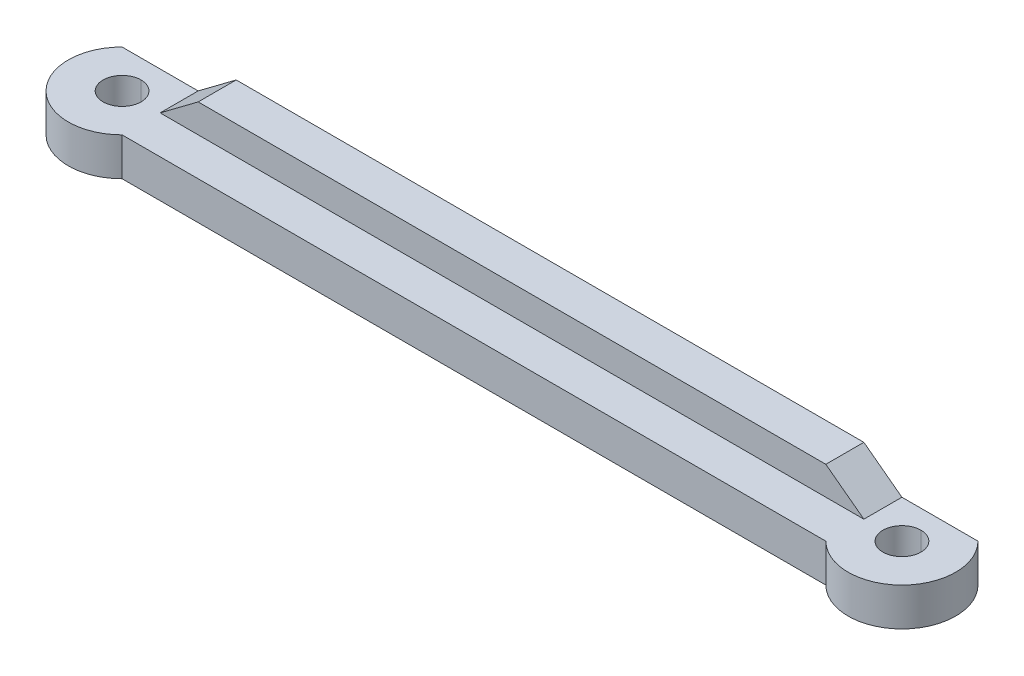
ISO-10303-21;
HEADER;
FILE_DESCRIPTION(('STEP AP214'),'2;1');
FILE_NAME('part.step','',(''),(''),'','','');
FILE_SCHEMA(('AUTOMOTIVE_DESIGN { 1 0 10303 214 1 1 1 1 }'));
ENDSEC;
DATA;
#1=APPLICATION_CONTEXT('core data for automotive mechanical design processes');
#2=APPLICATION_PROTOCOL_DEFINITION('international standard','automotive_design',2000,#1);
#3=PRODUCT_CONTEXT('',#1,'mechanical');
#4=PRODUCT('Part','Part','',(#3));
#5=PRODUCT_RELATED_PRODUCT_CATEGORY('part','',(#4));
#6=PRODUCT_DEFINITION_FORMATION('','',#4);
#7=PRODUCT_DEFINITION_CONTEXT('part definition',#1,'design');
#8=PRODUCT_DEFINITION('design','',#6,#7);
#9=PRODUCT_DEFINITION_SHAPE('','',#8);
#10=(LENGTH_UNIT() NAMED_UNIT(*) SI_UNIT(.MILLI.,.METRE.));
#11=(NAMED_UNIT(*) PLANE_ANGLE_UNIT() SI_UNIT($,.RADIAN.));
#12=(NAMED_UNIT(*) SI_UNIT($,.STERADIAN.) SOLID_ANGLE_UNIT());
#13=UNCERTAINTY_MEASURE_WITH_UNIT(LENGTH_MEASURE(1.E-05),#10,'distance_accuracy_value','');
#14=(GEOMETRIC_REPRESENTATION_CONTEXT(3) GLOBAL_UNCERTAINTY_ASSIGNED_CONTEXT((#13)) GLOBAL_UNIT_ASSIGNED_CONTEXT((#10,
#11,#12)) REPRESENTATION_CONTEXT('',''));
#15=CARTESIAN_POINT('',(0.,0.,0.));
#16=DIRECTION('',(0.,0.,1.));
#17=DIRECTION('',(1.,0.,0.));
#18=AXIS2_PLACEMENT_3D('',#15,#16,#17);
#19=CARTESIAN_POINT('',(-15.,-0.924793348750796,-1.88150014228968));
#20=DIRECTION('',(0.,0.,1.));
#21=DIRECTION('',(1.,0.,0.));
#22=AXIS2_PLACEMENT_3D('',#19,#20,#21);
#23=PLANE('',#22);
#24=DIRECTION('',(-1.,0.,0.));
#25=VECTOR('',#24,1.);
#26=CARTESIAN_POINT('',(53.3333333333333,2.40853998458254,-1.88150014228968));
#27=LINE('',#26,#25);
#28=CARTESIAN_POINT('',(53.3333333333333,2.40853998458254,-1.88150014228968));
#29=VERTEX_POINT('',#28);
#30=CARTESIAN_POINT('',(-8.33333333333334,2.40853998458254,-1.88150014228968));
#31=VERTEX_POINT('',#30);
#32=EDGE_CURVE('P0_E218',#29,#31,#27,.T.);
#33=ORIENTED_EDGE('',*,*,#32,.F.);
#34=DIRECTION('',(0.8,-0.6,0.));
#35=VECTOR('',#34,1.);
#36=CARTESIAN_POINT('',(53.3333333333333,2.40853998458254,-1.88150014228968));
#37=LINE('',#36,#35);
#38=CARTESIAN_POINT('',(50.,4.90853998458254,-1.88150014228968));
#39=VERTEX_POINT('',#38);
#40=EDGE_CURVE('P0_E182',#39,#29,#37,.T.);
#41=ORIENTED_EDGE('',*,*,#40,.F.);
#42=DIRECTION('',(1.,0.,0.));
#43=VECTOR('',#42,1.);
#44=CARTESIAN_POINT('',(50.,4.90853998458254,-1.88150014228968));
#45=LINE('',#44,#43);
#46=CARTESIAN_POINT('',(-5.,4.90853998458254,-1.88150014228968));
#47=VERTEX_POINT('',#46);
#48=EDGE_CURVE('P0_E55',#47,#39,#45,.T.);
#49=ORIENTED_EDGE('',*,*,#48,.F.);
#50=DIRECTION('',(0.8,0.6,0.));
#51=VECTOR('',#50,1.);
#52=CARTESIAN_POINT('',(-5.,4.90853998458254,-1.88150014228968));
#53=LINE('',#52,#51);
#54=EDGE_CURVE('P0_E11',#31,#47,#53,.T.);
#55=ORIENTED_EDGE('',*,*,#54,.F.);
#56=EDGE_LOOP('',(#33,#41,#49,#55));
#57=FACE_BOUND('',#56,.T.);
#58=ADVANCED_FACE('P0_F44',(#57),#23,.T.);
#59=CARTESIAN_POINT('',(-5.,4.90853998458254,-1.88150014228968));
#60=DIRECTION('',(-0.6,0.8,0.));
#61=DIRECTION('',(0.,0.,1.));
#62=AXIS2_PLACEMENT_3D('',#59,#60,#61);
#63=PLANE('',#62);
#64=DIRECTION('',(0.8,0.6,0.));
#65=VECTOR('',#64,1.);
#66=CARTESIAN_POINT('',(-5.,4.90853998458254,-5.21483347562302));
#67=LINE('',#66,#65);
#68=CARTESIAN_POINT('',(-8.33333333333334,2.40853998458254,-5.21483347562302));
#69=VERTEX_POINT('',#68);
#70=CARTESIAN_POINT('',(-5.,4.90853998458254,-5.21483347562302));
#71=VERTEX_POINT('',#70);
#72=EDGE_CURVE('P0_E196',#69,#71,#67,.T.);
#73=ORIENTED_EDGE('',*,*,#72,.F.);
#74=DIRECTION('',(0.,0.,-1.));
#75=VECTOR('',#74,1.);
#76=CARTESIAN_POINT('',(-8.33333333333334,2.40853998458254,-1.88150014228968));
#77=LINE('',#76,#75);
#78=EDGE_CURVE('P0_E215',#31,#69,#77,.T.);
#79=ORIENTED_EDGE('',*,*,#78,.F.);
#80=ORIENTED_EDGE('',*,*,#54,.T.);
#81=DIRECTION('',(0.,0.,-1.));
#82=VECTOR('',#81,1.);
#83=CARTESIAN_POINT('',(-5.,4.90853998458254,-1.88150014228968));
#84=LINE('',#83,#82);
#85=EDGE_CURVE('P0_E181',#47,#71,#84,.T.);
#86=ORIENTED_EDGE('',*,*,#85,.T.);
#87=EDGE_LOOP('',(#73,#79,#80,#86));
#88=FACE_BOUND('',#87,.T.);
#89=ADVANCED_FACE('P0_F326',(#88),#63,.T.);
#90=CARTESIAN_POINT('',(50.,4.90853998458254,-1.88150014228968));
#91=DIRECTION('',(0.,1.,0.));
#92=DIRECTION('',(1.,0.,0.));
#93=AXIS2_PLACEMENT_3D('',#90,#91,#92);
#94=PLANE('',#93);
#95=DIRECTION('',(1.,0.,0.));
#96=VECTOR('',#95,1.);
#97=CARTESIAN_POINT('',(50.,4.90853998458254,-5.21483347562302));
#98=LINE('',#97,#96);
#99=CARTESIAN_POINT('',(50.,4.90853998458254,-5.21483347562302));
#100=VERTEX_POINT('',#99);
#101=EDGE_CURVE('P0_E253',#71,#100,#98,.T.);
#102=ORIENTED_EDGE('',*,*,#101,.F.);
#103=ORIENTED_EDGE('',*,*,#85,.F.);
#104=ORIENTED_EDGE('',*,*,#48,.T.);
#105=DIRECTION('',(0.,0.,-1.));
#106=VECTOR('',#105,1.);
#107=CARTESIAN_POINT('',(50.,4.90853998458254,-1.88150014228968));
#108=LINE('',#107,#106);
#109=EDGE_CURVE('P0_E186',#39,#100,#108,.T.);
#110=ORIENTED_EDGE('',*,*,#109,.T.);
#111=EDGE_LOOP('',(#102,#103,#104,#110));
#112=FACE_BOUND('',#111,.T.);
#113=ADVANCED_FACE('P0_F330',(#112),#94,.T.);
#114=CARTESIAN_POINT('',(53.3333333333333,2.40853998458254,-1.88150014228968));
#115=DIRECTION('',(0.6,0.8,0.));
#116=DIRECTION('',(0.,0.,-1.));
#117=AXIS2_PLACEMENT_3D('',#114,#115,#116);
#118=PLANE('',#117);
#119=DIRECTION('',(0.8,-0.6,0.));
#120=VECTOR('',#119,1.);
#121=CARTESIAN_POINT('',(53.3333333333333,2.40853998458254,-5.21483347562302));
#122=LINE('',#121,#120);
#123=CARTESIAN_POINT('',(53.3333333333333,2.40853998458254,-5.21483347562302));
#124=VERTEX_POINT('',#123);
#125=EDGE_CURVE('P0_E224',#100,#124,#122,.T.);
#126=ORIENTED_EDGE('',*,*,#125,.F.);
#127=ORIENTED_EDGE('',*,*,#109,.F.);
#128=ORIENTED_EDGE('',*,*,#40,.T.);
#129=DIRECTION('',(0.,0.,-1.));
#130=VECTOR('',#129,1.);
#131=CARTESIAN_POINT('',(53.3333333333333,2.40853998458254,-1.88150014228968));
#132=LINE('',#131,#130);
#133=EDGE_CURVE('P0_E209',#29,#124,#132,.T.);
#134=ORIENTED_EDGE('',*,*,#133,.T.);
#135=EDGE_LOOP('',(#126,#127,#128,#134));
#136=FACE_BOUND('',#135,.T.);
#137=ADVANCED_FACE('P0_F320',(#136),#118,.T.);
#138=CARTESIAN_POINT('',(-15.,-0.924793348750796,1.45183319104365));
#139=DIRECTION('',(0.,1.,0.));
#140=DIRECTION('',(1.,0.,0.));
#141=AXIS2_PLACEMENT_3D('',#138,#139,#140);
#142=PLANE('',#141);
#143=CARTESIAN_POINT('',(56.6666666666667,-0.924793348750796,-1.88150014228968));
#144=DIRECTION('',(0.,1.,0.));
#145=DIRECTION('',(0.,0.,1.));
#146=AXIS2_PLACEMENT_3D('',#143,#144,#145);
#147=CIRCLE('',#146,1.66666666666667);
#148=CARTESIAN_POINT('',(56.6666666666667,-0.924793348750796,-3.54816680895635));
#149=VERTEX_POINT('',#148);
#150=CARTESIAN_POINT('',(56.6666666666667,-0.924793348750796,-0.214833475623016));
#151=VERTEX_POINT('',#150);
#152=EDGE_CURVE('P0_E197',#149,#151,#147,.T.);
#153=ORIENTED_EDGE('',*,*,#152,.T.);
#154=CARTESIAN_POINT('',(56.6666666666667,-0.924793348750796,-1.88150014228968));
#155=DIRECTION('',(0.,1.,0.));
#156=DIRECTION('',(0.,0.,1.));
#157=AXIS2_PLACEMENT_3D('',#154,#155,#156);
#158=CIRCLE('',#157,1.66666666666667);
#159=EDGE_CURVE('P0_E206',#151,#149,#158,.T.);
#160=ORIENTED_EDGE('',*,*,#159,.T.);
#161=EDGE_LOOP('',(#153,#160));
#162=FACE_BOUND('',#161,.T.);
#163=CARTESIAN_POINT('',(-11.6666666666667,-0.924793348750796,-1.88150014228968));
#164=DIRECTION('',(0.,1.,0.));
#165=DIRECTION('',(0.,0.,1.));
#166=AXIS2_PLACEMENT_3D('',#163,#164,#165);
#167=CIRCLE('',#166,1.66666666666667);
#168=CARTESIAN_POINT('',(-11.6666666666667,-0.924793348750796,-3.54816680895635));
#169=VERTEX_POINT('',#168);
#170=CARTESIAN_POINT('',(-11.6666666666667,-0.924793348750796,-0.214833475623016));
#171=VERTEX_POINT('',#170);
#172=EDGE_CURVE('P0_E168',#169,#171,#167,.T.);
#173=ORIENTED_EDGE('',*,*,#172,.T.);
#174=CARTESIAN_POINT('',(-11.6666666666667,-0.924793348750796,-1.88150014228968));
#175=DIRECTION('',(0.,1.,0.));
#176=DIRECTION('',(0.,0.,1.));
#177=AXIS2_PLACEMENT_3D('',#174,#175,#176);
#178=CIRCLE('',#177,1.66666666666667);
#179=EDGE_CURVE('P0_E214',#171,#169,#178,.T.);
#180=ORIENTED_EDGE('',*,*,#179,.T.);
#181=EDGE_LOOP('',(#173,#180));
#182=FACE_BOUND('',#181,.T.);
#183=DIRECTION('',(1.,0.,0.));
#184=VECTOR('',#183,1.);
#185=CARTESIAN_POINT('',(-15.,-0.924793348750796,1.45183319104365));
#186=LINE('',#185,#184);
#187=CARTESIAN_POINT('',(-8.33333333333334,-0.924793348750796,1.45183319104365));
#188=VERTEX_POINT('',#187);
#189=CARTESIAN_POINT('',(53.3333333333333,-0.924793348750796,1.45183319104365));
#190=VERTEX_POINT('',#189);
#191=EDGE_CURVE('P0_E48',#188,#190,#186,.T.);
#192=ORIENTED_EDGE('',*,*,#191,.F.);
#193=CARTESIAN_POINT('',(-11.6666666666667,-0.924793348750796,-1.88150014228968));
#194=DIRECTION('',(0.,1.,0.));
#195=DIRECTION('',(0.,0.,1.));
#196=AXIS2_PLACEMENT_3D('',#193,#194,#195);
#197=CIRCLE('',#196,4.71404520791032);
#198=CARTESIAN_POINT('',(-15.,-0.924793348750796,-5.21483347562302));
#199=VERTEX_POINT('',#198);
#200=EDGE_CURVE('P0_E137',#199,#188,#197,.T.);
#201=ORIENTED_EDGE('',*,*,#200,.F.);
#202=DIRECTION('',(1.,0.,0.));
#203=VECTOR('',#202,1.);
#204=CARTESIAN_POINT('',(-15.,-0.924793348750796,-5.21483347562302));
#205=LINE('',#204,#203);
#206=CARTESIAN_POINT('',(60.,-0.924793348750796,-5.21483347562302));
#207=VERTEX_POINT('',#206);
#208=EDGE_CURVE('P0_E108',#199,#207,#205,.T.);
#209=ORIENTED_EDGE('',*,*,#208,.T.);
#210=CARTESIAN_POINT('',(56.6666666666667,-0.924793348750796,-1.88150014228968));
#211=DIRECTION('',(0.,1.,0.));
#212=DIRECTION('',(0.,0.,1.));
#213=AXIS2_PLACEMENT_3D('',#210,#211,#212);
#214=CIRCLE('',#213,4.71404520791032);
#215=EDGE_CURVE('P0_E193',#190,#207,#214,.T.);
#216=ORIENTED_EDGE('',*,*,#215,.F.);
#217=EDGE_LOOP('',(#192,#201,#209,#216));
#218=FACE_BOUND('',#217,.T.);
#219=ADVANCED_FACE('P0_F138',(#162,#182,#218),#142,.F.);
#220=CARTESIAN_POINT('',(-15.,2.40853998458254,1.45183319104365));
#221=DIRECTION('',(0.,1.,0.));
#222=DIRECTION('',(1.,0.,0.));
#223=AXIS2_PLACEMENT_3D('',#220,#221,#222);
#224=PLANE('',#223);
#225=CARTESIAN_POINT('',(56.6666666666667,2.40853998458254,-1.88150014228968));
#226=DIRECTION('',(0.,1.,0.));
#227=DIRECTION('',(0.,0.,1.));
#228=AXIS2_PLACEMENT_3D('',#225,#226,#227);
#229=CIRCLE('',#228,1.66666666666667);
#230=CARTESIAN_POINT('',(56.6666666666667,2.40853998458254,-3.54816680895635));
#231=VERTEX_POINT('',#230);
#232=CARTESIAN_POINT('',(56.6666666666667,2.40853998458254,-0.214833475623016));
#233=VERTEX_POINT('',#232);
#234=EDGE_CURVE('P0_E225',#231,#233,#229,.T.);
#235=ORIENTED_EDGE('',*,*,#234,.F.);
#236=CARTESIAN_POINT('',(56.6666666666667,2.40853998458254,-1.88150014228968));
#237=DIRECTION('',(0.,1.,0.));
#238=DIRECTION('',(0.,0.,1.));
#239=AXIS2_PLACEMENT_3D('',#236,#237,#238);
#240=CIRCLE('',#239,1.66666666666667);
#241=EDGE_CURVE('P0_E210',#233,#231,#240,.T.);
#242=ORIENTED_EDGE('',*,*,#241,.F.);
#243=EDGE_LOOP('',(#235,#242));
#244=FACE_BOUND('',#243,.T.);
#245=CARTESIAN_POINT('',(-11.6666666666667,2.40853998458254,-1.88150014228968));
#246=DIRECTION('',(0.,1.,0.));
#247=DIRECTION('',(0.,0.,1.));
#248=AXIS2_PLACEMENT_3D('',#245,#246,#247);
#249=CIRCLE('',#248,1.66666666666667);
#250=CARTESIAN_POINT('',(-11.6666666666667,2.40853998458254,-3.54816680895635));
#251=VERTEX_POINT('',#250);
#252=CARTESIAN_POINT('',(-11.6666666666667,2.40853998458254,-0.214833475623016));
#253=VERTEX_POINT('',#252);
#254=EDGE_CURVE('P0_E202',#251,#253,#249,.T.);
#255=ORIENTED_EDGE('',*,*,#254,.F.);
#256=CARTESIAN_POINT('',(-11.6666666666667,2.40853998458254,-1.88150014228968));
#257=DIRECTION('',(0.,1.,0.));
#258=DIRECTION('',(0.,0.,1.));
#259=AXIS2_PLACEMENT_3D('',#256,#257,#258);
#260=CIRCLE('',#259,1.66666666666667);
#261=EDGE_CURVE('P0_E237',#253,#251,#260,.T.);
#262=ORIENTED_EDGE('',*,*,#261,.F.);
#263=EDGE_LOOP('',(#255,#262));
#264=FACE_BOUND('',#263,.T.);
#265=ORIENTED_EDGE('',*,*,#133,.F.);
#266=ORIENTED_EDGE('',*,*,#32,.T.);
#267=ORIENTED_EDGE('',*,*,#78,.T.);
#268=DIRECTION('',(1.,0.,0.));
#269=VECTOR('',#268,1.);
#270=CARTESIAN_POINT('',(-15.,2.40853998458254,-5.21483347562302));
#271=LINE('',#270,#269);
#272=CARTESIAN_POINT('',(-15.,2.40853998458254,-5.21483347562302));
#273=VERTEX_POINT('',#272);
#274=EDGE_CURVE('P0_E151',#273,#69,#271,.T.);
#275=ORIENTED_EDGE('',*,*,#274,.F.);
#276=CARTESIAN_POINT('',(-11.6666666666667,2.40853998458254,-1.88150014228968));
#277=DIRECTION('',(0.,1.,0.));
#278=DIRECTION('',(0.,0.,1.));
#279=AXIS2_PLACEMENT_3D('',#276,#277,#278);
#280=CIRCLE('',#279,4.71404520791032);
#281=CARTESIAN_POINT('',(-8.33333333333334,2.40853998458254,1.45183319104365));
#282=VERTEX_POINT('',#281);
#283=EDGE_CURVE('P0_E122',#273,#282,#280,.T.);
#284=ORIENTED_EDGE('',*,*,#283,.T.);
#285=DIRECTION('',(1.,0.,0.));
#286=VECTOR('',#285,1.);
#287=CARTESIAN_POINT('',(-15.,2.40853998458254,1.45183319104365));
#288=LINE('',#287,#286);
#289=CARTESIAN_POINT('',(53.3333333333333,2.40853998458254,1.45183319104365));
#290=VERTEX_POINT('',#289);
#291=EDGE_CURVE('P0_E177',#282,#290,#288,.T.);
#292=ORIENTED_EDGE('',*,*,#291,.T.);
#293=CARTESIAN_POINT('',(56.6666666666667,2.40853998458254,-1.88150014228968));
#294=DIRECTION('',(0.,1.,0.));
#295=DIRECTION('',(0.,0.,1.));
#296=AXIS2_PLACEMENT_3D('',#293,#294,#295);
#297=CIRCLE('',#296,4.71404520791032);
#298=CARTESIAN_POINT('',(60.,2.40853998458254,-5.21483347562302));
#299=VERTEX_POINT('',#298);
#300=EDGE_CURVE('P0_E158',#290,#299,#297,.T.);
#301=ORIENTED_EDGE('',*,*,#300,.T.);
#302=DIRECTION('',(1.,0.,0.));
#303=VECTOR('',#302,1.);
#304=CARTESIAN_POINT('',(-15.,2.40853998458254,-5.21483347562302));
#305=LINE('',#304,#303);
#306=EDGE_CURVE('P0_E143',#124,#299,#305,.T.);
#307=ORIENTED_EDGE('',*,*,#306,.F.);
#308=EDGE_LOOP('',(#265,#266,#267,#275,#284,#292,#301,#307));
#309=FACE_BOUND('',#308,.T.);
#310=ADVANCED_FACE('P0_F267',(#244,#264,#309),#224,.T.);
#311=CARTESIAN_POINT('',(56.6666666666667,2.40853998458254,-1.88150014228968));
#312=DIRECTION('',(0.,-1.,0.));
#313=DIRECTION('',(0.,0.,-1.));
#314=AXIS2_PLACEMENT_3D('',#311,#312,#313);
#315=CYLINDRICAL_SURFACE('',#314,1.66666666666667);
#316=DIRECTION('',(0.,-1.,0.));
#317=VECTOR('',#316,1.);
#318=CARTESIAN_POINT('',(56.6666666666667,2.40853998458254,-0.214833475623016));
#319=LINE('',#318,#317);
#320=EDGE_CURVE('P0_E201',#233,#151,#319,.T.);
#321=ORIENTED_EDGE('',*,*,#320,.F.);
#322=ORIENTED_EDGE('',*,*,#241,.T.);
#323=DIRECTION('',(0.,-1.,0.));
#324=VECTOR('',#323,1.);
#325=CARTESIAN_POINT('',(56.6666666666667,2.40853998458254,-3.54816680895635));
#326=LINE('',#325,#324);
#327=EDGE_CURVE('P0_E166',#231,#149,#326,.T.);
#328=ORIENTED_EDGE('',*,*,#327,.T.);
#329=ORIENTED_EDGE('',*,*,#159,.F.);
#330=EDGE_LOOP('',(#321,#322,#328,#329));
#331=FACE_BOUND('',#330,.T.);
#332=ADVANCED_FACE('P0_F46',(#331),#315,.F.);
#333=CARTESIAN_POINT('',(-11.6666666666667,2.40853998458254,-1.88150014228968));
#334=DIRECTION('',(0.,-1.,0.));
#335=DIRECTION('',(0.,0.,-1.));
#336=AXIS2_PLACEMENT_3D('',#333,#334,#335);
#337=CYLINDRICAL_SURFACE('',#336,1.66666666666667);
#338=DIRECTION('',(0.,-1.,0.));
#339=VECTOR('',#338,1.);
#340=CARTESIAN_POINT('',(-11.6666666666667,2.40853998458254,-0.214833475623016));
#341=LINE('',#340,#339);
#342=EDGE_CURVE('P0_E173',#253,#171,#341,.T.);
#343=ORIENTED_EDGE('',*,*,#342,.F.);
#344=ORIENTED_EDGE('',*,*,#261,.T.);
#345=DIRECTION('',(0.,-1.,0.));
#346=VECTOR('',#345,1.);
#347=CARTESIAN_POINT('',(-11.6666666666667,2.40853998458254,-3.54816680895635));
#348=LINE('',#347,#346);
#349=EDGE_CURVE('P0_E172',#251,#169,#348,.T.);
#350=ORIENTED_EDGE('',*,*,#349,.T.);
#351=ORIENTED_EDGE('',*,*,#179,.F.);
#352=EDGE_LOOP('',(#343,#344,#350,#351));
#353=FACE_BOUND('',#352,.T.);
#354=ADVANCED_FACE('P0_F307',(#353),#337,.F.);
#355=CARTESIAN_POINT('',(-11.6666666666667,2.40853998458254,-1.88150014228968));
#356=DIRECTION('',(0.,-1.,0.));
#357=DIRECTION('',(0.,0.,-1.));
#358=AXIS2_PLACEMENT_3D('',#355,#356,#357);
#359=CYLINDRICAL_SURFACE('',#358,4.71404520791032);
#360=ORIENTED_EDGE('',*,*,#200,.T.);
#361=DIRECTION('',(0.,-1.,0.));
#362=VECTOR('',#361,1.);
#363=CARTESIAN_POINT('',(-8.33333333333334,2.40853998458254,1.45183319104365));
#364=LINE('',#363,#362);
#365=EDGE_CURVE('P0_E190',#282,#188,#364,.T.);
#366=ORIENTED_EDGE('',*,*,#365,.F.);
#367=ORIENTED_EDGE('',*,*,#283,.F.);
#368=DIRECTION('',(0.,-1.,0.));
#369=VECTOR('',#368,1.);
#370=CARTESIAN_POINT('',(-15.,2.40853998458254,-5.21483347562302));
#371=LINE('',#370,#369);
#372=EDGE_CURVE('P0_E146',#273,#199,#371,.T.);
#373=ORIENTED_EDGE('',*,*,#372,.T.);
#374=EDGE_LOOP('',(#360,#366,#367,#373));
#375=FACE_BOUND('',#374,.T.);
#376=ADVANCED_FACE('P0_F147',(#375),#359,.T.);
#377=CARTESIAN_POINT('',(-15.,2.40853998458254,-5.21483347562302));
#378=DIRECTION('',(0.,0.,-1.));
#379=DIRECTION('',(0.,-1.,0.));
#380=AXIS2_PLACEMENT_3D('',#377,#378,#379);
#381=PLANE('',#380);
#382=ORIENTED_EDGE('',*,*,#208,.F.);
#383=ORIENTED_EDGE('',*,*,#372,.F.);
#384=ORIENTED_EDGE('',*,*,#274,.T.);
#385=ORIENTED_EDGE('',*,*,#72,.T.);
#386=ORIENTED_EDGE('',*,*,#101,.T.);
#387=ORIENTED_EDGE('',*,*,#125,.T.);
#388=ORIENTED_EDGE('',*,*,#306,.T.);
#389=DIRECTION('',(0.,-1.,0.));
#390=VECTOR('',#389,1.);
#391=CARTESIAN_POINT('',(60.,2.40853998458254,-5.21483347562302));
#392=LINE('',#391,#390);
#393=EDGE_CURVE('P0_E155',#299,#207,#392,.T.);
#394=ORIENTED_EDGE('',*,*,#393,.T.);
#395=EDGE_LOOP('',(#382,#383,#384,#385,#386,#387,#388,#394));
#396=FACE_BOUND('',#395,.T.);
#397=ADVANCED_FACE('P0_F153',(#396),#381,.T.);
#398=CARTESIAN_POINT('',(56.6666666666667,2.40853998458254,-1.88150014228968));
#399=DIRECTION('',(0.,-1.,0.));
#400=DIRECTION('',(0.,0.,-1.));
#401=AXIS2_PLACEMENT_3D('',#398,#399,#400);
#402=CYLINDRICAL_SURFACE('',#401,4.71404520791032);
#403=ORIENTED_EDGE('',*,*,#215,.T.);
#404=ORIENTED_EDGE('',*,*,#393,.F.);
#405=ORIENTED_EDGE('',*,*,#300,.F.);
#406=DIRECTION('',(0.,-1.,0.));
#407=VECTOR('',#406,1.);
#408=CARTESIAN_POINT('',(53.3333333333333,2.40853998458254,1.45183319104365));
#409=LINE('',#408,#407);
#410=EDGE_CURVE('P0_E174',#290,#190,#409,.T.);
#411=ORIENTED_EDGE('',*,*,#410,.T.);
#412=EDGE_LOOP('',(#403,#404,#405,#411));
#413=FACE_BOUND('',#412,.T.);
#414=ADVANCED_FACE('P0_F335',(#413),#402,.T.);
#415=CARTESIAN_POINT('',(-15.,2.40853998458254,1.45183319104365));
#416=DIRECTION('',(0.,0.,-1.));
#417=DIRECTION('',(0.,-1.,0.));
#418=AXIS2_PLACEMENT_3D('',#415,#416,#417);
#419=PLANE('',#418);
#420=ORIENTED_EDGE('',*,*,#191,.T.);
#421=ORIENTED_EDGE('',*,*,#410,.F.);
#422=ORIENTED_EDGE('',*,*,#291,.F.);
#423=ORIENTED_EDGE('',*,*,#365,.T.);
#424=EDGE_LOOP('',(#420,#421,#422,#423));
#425=FACE_BOUND('',#424,.T.);
#426=ADVANCED_FACE('P0_F383',(#425),#419,.F.);
#427=CARTESIAN_POINT('',(-11.6666666666667,2.40853998458254,-1.88150014228968));
#428=DIRECTION('',(0.,-1.,0.));
#429=DIRECTION('',(0.,0.,-1.));
#430=AXIS2_PLACEMENT_3D('',#427,#428,#429);
#431=CYLINDRICAL_SURFACE('',#430,1.66666666666667);
#432=ORIENTED_EDGE('',*,*,#254,.T.);
#433=ORIENTED_EDGE('',*,*,#342,.T.);
#434=ORIENTED_EDGE('',*,*,#172,.F.);
#435=ORIENTED_EDGE('',*,*,#349,.F.);
#436=EDGE_LOOP('',(#432,#433,#434,#435));
#437=FACE_BOUND('',#436,.T.);
#438=ADVANCED_FACE('P0_F310',(#437),#431,.F.);
#439=CARTESIAN_POINT('',(56.6666666666667,2.40853998458254,-1.88150014228968));
#440=DIRECTION('',(0.,-1.,0.));
#441=DIRECTION('',(0.,0.,-1.));
#442=AXIS2_PLACEMENT_3D('',#439,#440,#441);
#443=CYLINDRICAL_SURFACE('',#442,1.66666666666667);
#444=ORIENTED_EDGE('',*,*,#234,.T.);
#445=ORIENTED_EDGE('',*,*,#320,.T.);
#446=ORIENTED_EDGE('',*,*,#152,.F.);
#447=ORIENTED_EDGE('',*,*,#327,.F.);
#448=EDGE_LOOP('',(#444,#445,#446,#447));
#449=FACE_BOUND('',#448,.T.);
#450=ADVANCED_FACE('P0_F410',(#449),#443,.F.);
#451=CLOSED_SHELL('',(#58,#89,#113,#137,#219,#310,#332,#354,#376,#397,#414,#426,#438,#450));
#452=MANIFOLD_SOLID_BREP('P0_B2',#451);
#453=CARTESIAN_POINT('',(0.,0.,-2.));
#454=DIRECTION('',(0.,0.,1.));
#455=DIRECTION('',(1.,0.,0.));
#456=AXIS2_PLACEMENT_3D('',#453,#454,#455);
#457=PLANE('',#456);
#458=DIRECTION('',(-1.,0.,0.));
#459=VECTOR('',#458,1.);
#460=CARTESIAN_POINT('',(41.,2.,-2.));
#461=LINE('',#460,#459);
#462=CARTESIAN_POINT('',(41.,2.,-2.));
#463=VERTEX_POINT('',#462);
#464=CARTESIAN_POINT('',(4.,2.,-2.));
#465=VERTEX_POINT('',#464);
#466=EDGE_CURVE('P1_E198',#463,#465,#461,.T.);
#467=ORIENTED_EDGE('',*,*,#466,.F.);
#468=DIRECTION('',(0.8,-0.6,0.));
#469=VECTOR('',#468,1.);
#470=CARTESIAN_POINT('',(41.,2.,-2.));
#471=LINE('',#470,#469);
#472=CARTESIAN_POINT('',(39.,3.5,-2.));
#473=VERTEX_POINT('',#472);
#474=EDGE_CURVE('P1_E162',#473,#463,#471,.T.);
#475=ORIENTED_EDGE('',*,*,#474,.F.);
#476=DIRECTION('',(1.,0.,0.));
#477=VECTOR('',#476,1.);
#478=CARTESIAN_POINT('',(39.,3.5,-2.));
#479=LINE('',#478,#477);
#480=CARTESIAN_POINT('',(6.,3.5,-2.));
#481=VERTEX_POINT('',#480);
#482=EDGE_CURVE('P1_E27',#481,#473,#479,.T.);
#483=ORIENTED_EDGE('',*,*,#482,.F.);
#484=DIRECTION('',(0.8,0.6,0.));
#485=VECTOR('',#484,1.);
#486=CARTESIAN_POINT('',(6.,3.5,-2.));
#487=LINE('',#486,#485);
#488=EDGE_CURVE('P1_E11',#465,#481,#487,.T.);
#489=ORIENTED_EDGE('',*,*,#488,.F.);
#490=EDGE_LOOP('',(#467,#475,#483,#489));
#491=FACE_BOUND('',#490,.T.);
#492=ADVANCED_FACE('P1_F16',(#491),#457,.T.);
#493=CARTESIAN_POINT('',(6.,3.5,-2.));
#494=DIRECTION('',(-0.6,0.8,0.));
#495=DIRECTION('',(0.,0.,1.));
#496=AXIS2_PLACEMENT_3D('',#493,#494,#495);
#497=PLANE('',#496);
#498=DIRECTION('',(0.8,0.6,0.));
#499=VECTOR('',#498,1.);
#500=CARTESIAN_POINT('',(6.,3.5,-4.));
#501=LINE('',#500,#499);
#502=CARTESIAN_POINT('',(4.,2.,-4.));
#503=VERTEX_POINT('',#502);
#504=CARTESIAN_POINT('',(6.,3.5,-4.));
#505=VERTEX_POINT('',#504);
#506=EDGE_CURVE('P1_E176',#503,#505,#501,.T.);
#507=ORIENTED_EDGE('',*,*,#506,.F.);
#508=DIRECTION('',(0.,0.,-1.));
#509=VECTOR('',#508,1.);
#510=CARTESIAN_POINT('',(4.,2.,-2.));
#511=LINE('',#510,#509);
#512=EDGE_CURVE('P1_E195',#465,#503,#511,.T.);
#513=ORIENTED_EDGE('',*,*,#512,.F.);
#514=ORIENTED_EDGE('',*,*,#488,.T.);
#515=DIRECTION('',(0.,0.,-1.));
#516=VECTOR('',#515,1.);
#517=CARTESIAN_POINT('',(6.,3.5,-2.));
#518=LINE('',#517,#516);
#519=EDGE_CURVE('P1_E161',#481,#505,#518,.T.);
#520=ORIENTED_EDGE('',*,*,#519,.T.);
#521=EDGE_LOOP('',(#507,#513,#514,#520));
#522=FACE_BOUND('',#521,.T.);
#523=ADVANCED_FACE('P1_F315',(#522),#497,.T.);
#524=CARTESIAN_POINT('',(39.,3.5,-2.));
#525=DIRECTION('',(0.,1.,0.));
#526=DIRECTION('',(1.,0.,0.));
#527=AXIS2_PLACEMENT_3D('',#524,#525,#526);
#528=PLANE('',#527);
#529=DIRECTION('',(1.,0.,0.));
#530=VECTOR('',#529,1.);
#531=CARTESIAN_POINT('',(39.,3.5,-4.));
#532=LINE('',#531,#530);
#533=CARTESIAN_POINT('',(39.,3.5,-4.));
#534=VERTEX_POINT('',#533);
#535=EDGE_CURVE('P1_E237',#505,#534,#532,.T.);
#536=ORIENTED_EDGE('',*,*,#535,.F.);
#537=ORIENTED_EDGE('',*,*,#519,.F.);
#538=ORIENTED_EDGE('',*,*,#482,.T.);
#539=DIRECTION('',(0.,0.,-1.));
#540=VECTOR('',#539,1.);
#541=CARTESIAN_POINT('',(39.,3.5,-2.));
#542=LINE('',#541,#540);
#543=EDGE_CURVE('P1_E166',#473,#534,#542,.T.);
#544=ORIENTED_EDGE('',*,*,#543,.T.);
#545=EDGE_LOOP('',(#536,#537,#538,#544));
#546=FACE_BOUND('',#545,.T.);
#547=ADVANCED_FACE('P1_F319',(#546),#528,.T.);
#548=CARTESIAN_POINT('',(41.,2.,-2.));
#549=DIRECTION('',(0.6,0.8,0.));
#550=DIRECTION('',(0.,0.,-1.));
#551=AXIS2_PLACEMENT_3D('',#548,#549,#550);
#552=PLANE('',#551);
#553=DIRECTION('',(0.8,-0.6,0.));
#554=VECTOR('',#553,1.);
#555=CARTESIAN_POINT('',(41.,2.,-4.));
#556=LINE('',#555,#554);
#557=CARTESIAN_POINT('',(41.,2.,-4.));
#558=VERTEX_POINT('',#557);
#559=EDGE_CURVE('P1_E204',#534,#558,#556,.T.);
#560=ORIENTED_EDGE('',*,*,#559,.F.);
#561=ORIENTED_EDGE('',*,*,#543,.F.);
#562=ORIENTED_EDGE('',*,*,#474,.T.);
#563=DIRECTION('',(0.,0.,-1.));
#564=VECTOR('',#563,1.);
#565=CARTESIAN_POINT('',(41.,2.,-2.));
#566=LINE('',#565,#564);
#567=EDGE_CURVE('P1_E189',#463,#558,#566,.T.);
#568=ORIENTED_EDGE('',*,*,#567,.T.);
#569=EDGE_LOOP('',(#560,#561,#562,#568));
#570=FACE_BOUND('',#569,.T.);
#571=ADVANCED_FACE('P1_F309',(#570),#552,.T.);
#572=CARTESIAN_POINT('',(0.,0.,0.));
#573=DIRECTION('',(0.,1.,0.));
#574=DIRECTION('',(1.,0.,0.));
#575=AXIS2_PLACEMENT_3D('',#572,#573,#574);
#576=PLANE('',#575);
#577=CARTESIAN_POINT('',(43.,0.,-2.));
#578=DIRECTION('',(0.,1.,0.));
#579=DIRECTION('',(0.,0.,1.));
#580=AXIS2_PLACEMENT_3D('',#577,#578,#579);
#581=CIRCLE('',#580,1.);
#582=CARTESIAN_POINT('',(43.,0.,-3.));
#583=VERTEX_POINT('',#582);
#584=CARTESIAN_POINT('',(43.,0.,-1.));
#585=VERTEX_POINT('',#584);
#586=EDGE_CURVE('P1_E177',#583,#585,#581,.T.);
#587=ORIENTED_EDGE('',*,*,#586,.T.);
#588=CARTESIAN_POINT('',(43.,0.,-2.));
#589=DIRECTION('',(0.,1.,0.));
#590=DIRECTION('',(0.,0.,1.));
#591=AXIS2_PLACEMENT_3D('',#588,#589,#590);
#592=CIRCLE('',#591,1.);
#593=EDGE_CURVE('P1_E186',#585,#583,#592,.T.);
#594=ORIENTED_EDGE('',*,*,#593,.T.);
#595=EDGE_LOOP('',(#587,#594));
#596=FACE_BOUND('',#595,.T.);
#597=CARTESIAN_POINT('',(2.,0.,-2.));
#598=DIRECTION('',(0.,1.,0.));
#599=DIRECTION('',(0.,0.,1.));
#600=AXIS2_PLACEMENT_3D('',#597,#598,#599);
#601=CIRCLE('',#600,1.);
#602=CARTESIAN_POINT('',(2.,0.,-3.));
#603=VERTEX_POINT('',#602);
#604=CARTESIAN_POINT('',(2.,0.,-1.));
#605=VERTEX_POINT('',#604);
#606=EDGE_CURVE('P1_E149',#603,#605,#601,.T.);
#607=ORIENTED_EDGE('',*,*,#606,.T.);
#608=CARTESIAN_POINT('',(2.,0.,-2.));
#609=DIRECTION('',(0.,1.,0.));
#610=DIRECTION('',(0.,0.,1.));
#611=AXIS2_PLACEMENT_3D('',#608,#609,#610);
#612=CIRCLE('',#611,1.);
#613=EDGE_CURVE('P1_E194',#605,#603,#612,.T.);
#614=ORIENTED_EDGE('',*,*,#613,.T.);
#615=EDGE_LOOP('',(#607,#614));
#616=FACE_BOUND('',#615,.T.);
#617=DIRECTION('',(1.,0.,0.));
#618=VECTOR('',#617,1.);
#619=CARTESIAN_POINT('',(0.,0.,0.));
#620=LINE('',#619,#618);
#621=CARTESIAN_POINT('',(4.,0.,0.));
#622=VERTEX_POINT('',#621);
#623=CARTESIAN_POINT('',(41.,0.,0.));
#624=VERTEX_POINT('',#623);
#625=EDGE_CURVE('P1_E20',#622,#624,#620,.T.);
#626=ORIENTED_EDGE('',*,*,#625,.F.);
#627=CARTESIAN_POINT('',(2.,0.,-2.));
#628=DIRECTION('',(0.,1.,0.));
#629=DIRECTION('',(0.,0.,1.));
#630=AXIS2_PLACEMENT_3D('',#627,#628,#629);
#631=CIRCLE('',#630,2.82842712474619);
#632=CARTESIAN_POINT('',(0.,0.,-4.));
#633=VERTEX_POINT('',#632);
#634=EDGE_CURVE('P1_E115',#633,#622,#631,.T.);
#635=ORIENTED_EDGE('',*,*,#634,.F.);
#636=DIRECTION('',(1.,0.,0.));
#637=VECTOR('',#636,1.);
#638=CARTESIAN_POINT('',(0.,0.,-4.));
#639=LINE('',#638,#637);
#640=CARTESIAN_POINT('',(45.,0.,-4.));
#641=VERTEX_POINT('',#640);
#642=EDGE_CURVE('P1_E83',#633,#641,#639,.T.);
#643=ORIENTED_EDGE('',*,*,#642,.T.);
#644=CARTESIAN_POINT('',(43.,0.,-2.));
#645=DIRECTION('',(0.,1.,0.));
#646=DIRECTION('',(0.,0.,1.));
#647=AXIS2_PLACEMENT_3D('',#644,#645,#646);
#648=CIRCLE('',#647,2.82842712474619);
#649=EDGE_CURVE('P1_E173',#624,#641,#648,.T.);
#650=ORIENTED_EDGE('',*,*,#649,.F.);
#651=EDGE_LOOP('',(#626,#635,#643,#650));
#652=FACE_BOUND('',#651,.T.);
#653=ADVANCED_FACE('P1_F116',(#596,#616,#652),#576,.F.);
#654=CARTESIAN_POINT('',(0.,2.,0.));
#655=DIRECTION('',(0.,1.,0.));
#656=DIRECTION('',(1.,0.,0.));
#657=AXIS2_PLACEMENT_3D('',#654,#655,#656);
#658=PLANE('',#657);
#659=CARTESIAN_POINT('',(43.,2.,-2.));
#660=DIRECTION('',(0.,1.,0.));
#661=DIRECTION('',(0.,0.,1.));
#662=AXIS2_PLACEMENT_3D('',#659,#660,#661);
#663=CIRCLE('',#662,1.);
#664=CARTESIAN_POINT('',(43.,2.,-3.));
#665=VERTEX_POINT('',#664);
#666=CARTESIAN_POINT('',(43.,2.,-1.));
#667=VERTEX_POINT('',#666);
#668=EDGE_CURVE('P1_E205',#665,#667,#663,.T.);
#669=ORIENTED_EDGE('',*,*,#668,.F.);
#670=CARTESIAN_POINT('',(43.,2.,-2.));
#671=DIRECTION('',(0.,1.,0.));
#672=DIRECTION('',(0.,0.,1.));
#673=AXIS2_PLACEMENT_3D('',#670,#671,#672);
#674=CIRCLE('',#673,1.);
#675=EDGE_CURVE('P1_E190',#667,#665,#674,.T.);
#676=ORIENTED_EDGE('',*,*,#675,.F.);
#677=EDGE_LOOP('',(#669,#676));
#678=FACE_BOUND('',#677,.T.);
#679=CARTESIAN_POINT('',(2.,2.,-2.));
#680=DIRECTION('',(0.,1.,0.));
#681=DIRECTION('',(0.,0.,1.));
#682=AXIS2_PLACEMENT_3D('',#679,#680,#681);
#683=CIRCLE('',#682,1.);
#684=CARTESIAN_POINT('',(2.,2.,-3.));
#685=VERTEX_POINT('',#684);
#686=CARTESIAN_POINT('',(2.,2.,-1.));
#687=VERTEX_POINT('',#686);
#688=EDGE_CURVE('P1_E182',#685,#687,#683,.T.);
#689=ORIENTED_EDGE('',*,*,#688,.F.);
#690=CARTESIAN_POINT('',(2.,2.,-2.));
#691=DIRECTION('',(0.,1.,0.));
#692=DIRECTION('',(0.,0.,1.));
#693=AXIS2_PLACEMENT_3D('',#690,#691,#692);
#694=CIRCLE('',#693,1.);
#695=EDGE_CURVE('P1_E217',#687,#685,#694,.T.);
#696=ORIENTED_EDGE('',*,*,#695,.F.);
#697=EDGE_LOOP('',(#689,#696));
#698=FACE_BOUND('',#697,.T.);
#699=ORIENTED_EDGE('',*,*,#567,.F.);
#700=ORIENTED_EDGE('',*,*,#466,.T.);
#701=ORIENTED_EDGE('',*,*,#512,.T.);
#702=DIRECTION('',(1.,0.,0.));
#703=VECTOR('',#702,1.);
#704=CARTESIAN_POINT('',(0.,2.,-4.));
#705=LINE('',#704,#703);
#706=CARTESIAN_POINT('',(0.,2.,-4.));
#707=VERTEX_POINT('',#706);
#708=EDGE_CURVE('P1_E129',#707,#503,#705,.T.);
#709=ORIENTED_EDGE('',*,*,#708,.F.);
#710=CARTESIAN_POINT('',(2.,2.,-2.));
#711=DIRECTION('',(0.,1.,0.));
#712=DIRECTION('',(0.,0.,1.));
#713=AXIS2_PLACEMENT_3D('',#710,#711,#712);
#714=CIRCLE('',#713,2.82842712474619);
#715=CARTESIAN_POINT('',(4.,2.,0.));
#716=VERTEX_POINT('',#715);
#717=EDGE_CURVE('P1_E98',#707,#716,#714,.T.);
#718=ORIENTED_EDGE('',*,*,#717,.T.);
#719=DIRECTION('',(1.,0.,0.));
#720=VECTOR('',#719,1.);
#721=CARTESIAN_POINT('',(0.,2.,0.));
#722=LINE('',#721,#720);
#723=CARTESIAN_POINT('',(41.,2.,0.));
#724=VERTEX_POINT('',#723);
#725=EDGE_CURVE('P1_E157',#716,#724,#722,.T.);
#726=ORIENTED_EDGE('',*,*,#725,.T.);
#727=CARTESIAN_POINT('',(43.,2.,-2.));
#728=DIRECTION('',(0.,1.,0.));
#729=DIRECTION('',(0.,0.,1.));
#730=AXIS2_PLACEMENT_3D('',#727,#728,#729);
#731=CIRCLE('',#730,2.82842712474619);
#732=CARTESIAN_POINT('',(45.,2.,-4.));
#733=VERTEX_POINT('',#732);
#734=EDGE_CURVE('P1_E136',#724,#733,#731,.T.);
#735=ORIENTED_EDGE('',*,*,#734,.T.);
#736=DIRECTION('',(1.,0.,0.));
#737=VECTOR('',#736,1.);
#738=CARTESIAN_POINT('',(0.,2.,-4.));
#739=LINE('',#738,#737);
#740=EDGE_CURVE('P1_E121',#558,#733,#739,.T.);
#741=ORIENTED_EDGE('',*,*,#740,.F.);
#742=EDGE_LOOP('',(#699,#700,#701,#709,#718,#726,#735,#741));
#743=FACE_BOUND('',#742,.T.);
#744=ADVANCED_FACE('P1_F252',(#678,#698,#743),#658,.T.);
#745=CARTESIAN_POINT('',(43.,2.,-2.));
#746=DIRECTION('',(0.,-1.,0.));
#747=DIRECTION('',(0.,0.,-1.));
#748=AXIS2_PLACEMENT_3D('',#745,#746,#747);
#749=CYLINDRICAL_SURFACE('',#748,1.);
#750=DIRECTION('',(0.,-1.,0.));
#751=VECTOR('',#750,1.);
#752=CARTESIAN_POINT('',(43.,2.,-1.));
#753=LINE('',#752,#751);
#754=EDGE_CURVE('P1_E181',#667,#585,#753,.T.);
#755=ORIENTED_EDGE('',*,*,#754,.F.);
#756=ORIENTED_EDGE('',*,*,#675,.T.);
#757=DIRECTION('',(0.,-1.,0.));
#758=VECTOR('',#757,1.);
#759=CARTESIAN_POINT('',(43.,2.,-3.));
#760=LINE('',#759,#758);
#761=EDGE_CURVE('P1_E147',#665,#583,#760,.T.);
#762=ORIENTED_EDGE('',*,*,#761,.T.);
#763=ORIENTED_EDGE('',*,*,#593,.F.);
#764=EDGE_LOOP('',(#755,#756,#762,#763));
#765=FACE_BOUND('',#764,.T.);
#766=ADVANCED_FACE('P1_F18',(#765),#749,.F.);
#767=CARTESIAN_POINT('',(2.,2.,-2.));
#768=DIRECTION('',(0.,-1.,0.));
#769=DIRECTION('',(0.,0.,-1.));
#770=AXIS2_PLACEMENT_3D('',#767,#768,#769);
#771=CYLINDRICAL_SURFACE('',#770,1.);
#772=DIRECTION('',(0.,-1.,0.));
#773=VECTOR('',#772,1.);
#774=CARTESIAN_POINT('',(2.,2.,-1.));
#775=LINE('',#774,#773);
#776=EDGE_CURVE('P1_E153',#687,#605,#775,.T.);
#777=ORIENTED_EDGE('',*,*,#776,.F.);
#778=ORIENTED_EDGE('',*,*,#695,.T.);
#779=DIRECTION('',(0.,-1.,0.));
#780=VECTOR('',#779,1.);
#781=CARTESIAN_POINT('',(2.,2.,-3.));
#782=LINE('',#781,#780);
#783=EDGE_CURVE('P1_E152',#685,#603,#782,.T.);
#784=ORIENTED_EDGE('',*,*,#783,.T.);
#785=ORIENTED_EDGE('',*,*,#613,.F.);
#786=EDGE_LOOP('',(#777,#778,#784,#785));
#787=FACE_BOUND('',#786,.T.);
#788=ADVANCED_FACE('P1_F295',(#787),#771,.F.);
#789=CARTESIAN_POINT('',(2.,2.,-2.));
#790=DIRECTION('',(0.,-1.,0.));
#791=DIRECTION('',(0.,0.,-1.));
#792=AXIS2_PLACEMENT_3D('',#789,#790,#791);
#793=CYLINDRICAL_SURFACE('',#792,2.82842712474619);
#794=ORIENTED_EDGE('',*,*,#634,.T.);
#795=DIRECTION('',(0.,-1.,0.));
#796=VECTOR('',#795,1.);
#797=CARTESIAN_POINT('',(4.,2.,0.));
#798=LINE('',#797,#796);
#799=EDGE_CURVE('P1_E170',#716,#622,#798,.T.);
#800=ORIENTED_EDGE('',*,*,#799,.F.);
#801=ORIENTED_EDGE('',*,*,#717,.F.);
#802=DIRECTION('',(0.,-1.,0.));
#803=VECTOR('',#802,1.);
#804=CARTESIAN_POINT('',(0.,2.,-4.));
#805=LINE('',#804,#803);
#806=EDGE_CURVE('P1_E124',#707,#633,#805,.T.);
#807=ORIENTED_EDGE('',*,*,#806,.T.);
#808=EDGE_LOOP('',(#794,#800,#801,#807));
#809=FACE_BOUND('',#808,.T.);
#810=ADVANCED_FACE('P1_F125',(#809),#793,.T.);
#811=CARTESIAN_POINT('',(0.,2.,-4.));
#812=DIRECTION('',(0.,0.,-1.));
#813=DIRECTION('',(0.,-1.,0.));
#814=AXIS2_PLACEMENT_3D('',#811,#812,#813);
#815=PLANE('',#814);
#816=ORIENTED_EDGE('',*,*,#642,.F.);
#817=ORIENTED_EDGE('',*,*,#806,.F.);
#818=ORIENTED_EDGE('',*,*,#708,.T.);
#819=ORIENTED_EDGE('',*,*,#506,.T.);
#820=ORIENTED_EDGE('',*,*,#535,.T.);
#821=ORIENTED_EDGE('',*,*,#559,.T.);
#822=ORIENTED_EDGE('',*,*,#740,.T.);
#823=DIRECTION('',(0.,-1.,0.));
#824=VECTOR('',#823,1.);
#825=CARTESIAN_POINT('',(45.,2.,-4.));
#826=LINE('',#825,#824);
#827=EDGE_CURVE('P1_E133',#733,#641,#826,.T.);
#828=ORIENTED_EDGE('',*,*,#827,.T.);
#829=EDGE_LOOP('',(#816,#817,#818,#819,#820,#821,#822,#828));
#830=FACE_BOUND('',#829,.T.);
#831=ADVANCED_FACE('P1_F131',(#830),#815,.T.);
#832=CARTESIAN_POINT('',(43.,2.,-2.));
#833=DIRECTION('',(0.,-1.,0.));
#834=DIRECTION('',(0.,0.,-1.));
#835=AXIS2_PLACEMENT_3D('',#832,#833,#834);
#836=CYLINDRICAL_SURFACE('',#835,2.82842712474619);
#837=ORIENTED_EDGE('',*,*,#649,.T.);
#838=ORIENTED_EDGE('',*,*,#827,.F.);
#839=ORIENTED_EDGE('',*,*,#734,.F.);
#840=DIRECTION('',(0.,-1.,0.));
#841=VECTOR('',#840,1.);
#842=CARTESIAN_POINT('',(41.,2.,0.));
#843=LINE('',#842,#841);
#844=EDGE_CURVE('P1_E154',#724,#624,#843,.T.);
#845=ORIENTED_EDGE('',*,*,#844,.T.);
#846=EDGE_LOOP('',(#837,#838,#839,#845));
#847=FACE_BOUND('',#846,.T.);
#848=ADVANCED_FACE('P1_F324',(#847),#836,.T.);
#849=CARTESIAN_POINT('',(0.,2.,0.));
#850=DIRECTION('',(0.,0.,-1.));
#851=DIRECTION('',(0.,-1.,0.));
#852=AXIS2_PLACEMENT_3D('',#849,#850,#851);
#853=PLANE('',#852);
#854=ORIENTED_EDGE('',*,*,#625,.T.);
#855=ORIENTED_EDGE('',*,*,#844,.F.);
#856=ORIENTED_EDGE('',*,*,#725,.F.);
#857=ORIENTED_EDGE('',*,*,#799,.T.);
#858=EDGE_LOOP('',(#854,#855,#856,#857));
#859=FACE_BOUND('',#858,.T.);
#860=ADVANCED_FACE('P1_F437',(#859),#853,.F.);
#861=CARTESIAN_POINT('',(2.,2.,-2.));
#862=DIRECTION('',(0.,-1.,0.));
#863=DIRECTION('',(0.,0.,-1.));
#864=AXIS2_PLACEMENT_3D('',#861,#862,#863);
#865=CYLINDRICAL_SURFACE('',#864,1.);
#866=ORIENTED_EDGE('',*,*,#688,.T.);
#867=ORIENTED_EDGE('',*,*,#776,.T.);
#868=ORIENTED_EDGE('',*,*,#606,.F.);
#869=ORIENTED_EDGE('',*,*,#783,.F.);
#870=EDGE_LOOP('',(#866,#867,#868,#869));
#871=FACE_BOUND('',#870,.T.);
#872=ADVANCED_FACE('P1_F298',(#871),#865,.F.);
#873=CARTESIAN_POINT('',(43.,2.,-2.));
#874=DIRECTION('',(0.,-1.,0.));
#875=DIRECTION('',(0.,0.,-1.));
#876=AXIS2_PLACEMENT_3D('',#873,#874,#875);
#877=CYLINDRICAL_SURFACE('',#876,1.);
#878=ORIENTED_EDGE('',*,*,#668,.T.);
#879=ORIENTED_EDGE('',*,*,#754,.T.);
#880=ORIENTED_EDGE('',*,*,#586,.F.);
#881=ORIENTED_EDGE('',*,*,#761,.F.);
#882=EDGE_LOOP('',(#878,#879,#880,#881));
#883=FACE_BOUND('',#882,.T.);
#884=ADVANCED_FACE('P1_F353',(#883),#877,.F.);
#885=CLOSED_SHELL('',(#492,#523,#547,#571,#653,#744,#766,#788,#810,#831,#848,#860,#872,#884));
#886=MANIFOLD_SOLID_BREP('P1_B1',#885);
#887=ADVANCED_BREP_SHAPE_REPRESENTATION('',(#18,#452,#886),#14);
#888=SHAPE_DEFINITION_REPRESENTATION(#9,#887);
ENDSEC;
END-ISO-10303-21;
